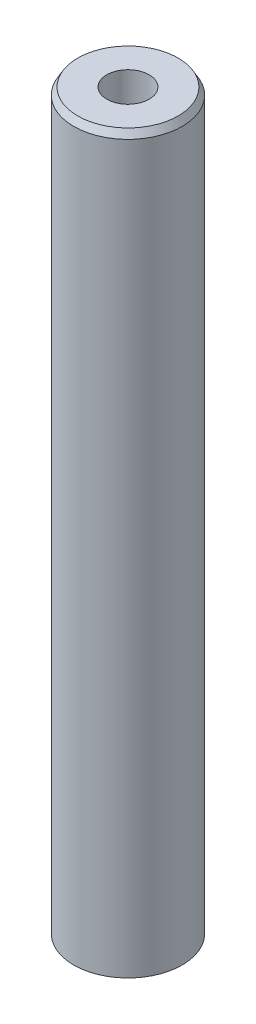
ISO-10303-21;
HEADER;
FILE_DESCRIPTION(('STEP AP214'),'2;1');
FILE_NAME('part.step','',(''),(''),'','','');
FILE_SCHEMA(('AUTOMOTIVE_DESIGN { 1 0 10303 214 1 1 1 1 }'));
ENDSEC;
DATA;
#1=APPLICATION_CONTEXT('core data for automotive mechanical design processes');
#2=APPLICATION_PROTOCOL_DEFINITION('international standard','automotive_design',2000,#1);
#3=PRODUCT_CONTEXT('',#1,'mechanical');
#4=PRODUCT('Part','Part','',(#3));
#5=PRODUCT_RELATED_PRODUCT_CATEGORY('part','',(#4));
#6=PRODUCT_DEFINITION_FORMATION('','',#4);
#7=PRODUCT_DEFINITION_CONTEXT('part definition',#1,'design');
#8=PRODUCT_DEFINITION('design','',#6,#7);
#9=PRODUCT_DEFINITION_SHAPE('','',#8);
#10=(LENGTH_UNIT() NAMED_UNIT(*) SI_UNIT(.MILLI.,.METRE.));
#11=(NAMED_UNIT(*) PLANE_ANGLE_UNIT() SI_UNIT($,.RADIAN.));
#12=(NAMED_UNIT(*) SI_UNIT($,.STERADIAN.) SOLID_ANGLE_UNIT());
#13=UNCERTAINTY_MEASURE_WITH_UNIT(LENGTH_MEASURE(1.E-05),#10,'distance_accuracy_value','');
#14=(GEOMETRIC_REPRESENTATION_CONTEXT(3) GLOBAL_UNCERTAINTY_ASSIGNED_CONTEXT((#13)) GLOBAL_UNIT_ASSIGNED_CONTEXT((#10,
#11,#12)) REPRESENTATION_CONTEXT('',''));
#15=CARTESIAN_POINT('',(0.,0.,0.));
#16=DIRECTION('',(0.,0.,1.));
#17=DIRECTION('',(1.,0.,0.));
#18=AXIS2_PLACEMENT_3D('',#15,#16,#17);
#19=CARTESIAN_POINT('',(0.,475.651455257944,0.));
#20=DIRECTION('',(0.,-1.,0.));
#21=DIRECTION('',(0.,0.,-1.));
#22=AXIS2_PLACEMENT_3D('',#19,#20,#21);
#23=CYLINDRICAL_SURFACE('',#22,35.);
#24=CARTESIAN_POINT('',(0.,471.122958494088,0.));
#25=DIRECTION('',(0.,1.,0.));
#26=DIRECTION('',(0.,0.,1.));
#27=AXIS2_PLACEMENT_3D('',#24,#25,#26);
#28=CIRCLE('',#27,35.);
#29=CARTESIAN_POINT('',(0.,471.122958494088,35.));
#30=VERTEX_POINT('',#29);
#31=EDGE_CURVE('E50',#30,#30,#28,.F.);
#32=ORIENTED_EDGE('',*,*,#31,.T.);
#33=EDGE_LOOP('',(#32));
#34=FACE_BOUND('',#33,.T.);
#35=CARTESIAN_POINT('',(0.,2.61452882563645,0.));
#36=DIRECTION('',(0.,1.,0.));
#37=DIRECTION('',(0.,0.,1.));
#38=AXIS2_PLACEMENT_3D('',#35,#36,#37);
#39=CIRCLE('',#38,35.);
#40=CARTESIAN_POINT('',(0.,2.61452882563645,35.));
#41=VERTEX_POINT('',#40);
#42=EDGE_CURVE('E51',#41,#41,#39,.T.);
#43=ORIENTED_EDGE('',*,*,#42,.T.);
#44=EDGE_LOOP('',(#43));
#45=FACE_BOUND('',#44,.T.);
#46=ADVANCED_FACE('F39',(#34,#45),#23,.T.);
#47=CARTESIAN_POINT('',(0.,475.651455257944,0.));
#48=DIRECTION('',(0.,1.,0.));
#49=DIRECTION('',(0.,0.,1.));
#50=AXIS2_PLACEMENT_3D('',#47,#48,#49);
#51=PLANE('',#50);
#52=CARTESIAN_POINT('',(0.,475.651455257944,0.));
#53=DIRECTION('',(0.,1.,0.));
#54=DIRECTION('',(0.,0.,1.));
#55=AXIS2_PLACEMENT_3D('',#52,#53,#54);
#56=CIRCLE('',#55,32.3854711743635);
#57=CARTESIAN_POINT('',(0.,475.651455257944,32.3854711743635));
#58=VERTEX_POINT('',#57);
#59=EDGE_CURVE('E54',#58,#58,#56,.T.);
#60=ORIENTED_EDGE('',*,*,#59,.T.);
#61=EDGE_LOOP('',(#60));
#62=FACE_BOUND('',#61,.T.);
#63=CARTESIAN_POINT('',(0.,475.651455257944,0.));
#64=DIRECTION('',(0.,1.,0.));
#65=DIRECTION('',(0.,0.,1.));
#66=AXIS2_PLACEMENT_3D('',#63,#64,#65);
#67=CIRCLE('',#66,13.674085344769);
#68=CARTESIAN_POINT('',(0.,475.651455257944,13.674085344769));
#69=VERTEX_POINT('',#68);
#70=EDGE_CURVE('E58',#69,#69,#67,.T.);
#71=ORIENTED_EDGE('',*,*,#70,.F.);
#72=EDGE_LOOP('',(#71));
#73=FACE_BOUND('',#72,.T.);
#74=ADVANCED_FACE('F69',(#62,#73),#51,.T.);
#75=CARTESIAN_POINT('',(0.,0.,0.));
#76=DIRECTION('',(0.,1.,0.));
#77=DIRECTION('',(0.,0.,1.));
#78=AXIS2_PLACEMENT_3D('',#75,#76,#77);
#79=PLANE('',#78);
#80=CARTESIAN_POINT('',(0.,0.,0.));
#81=DIRECTION('',(0.,1.,0.));
#82=DIRECTION('',(0.,0.,1.));
#83=AXIS2_PLACEMENT_3D('',#80,#81,#82);
#84=CIRCLE('',#83,30.4715032361442);
#85=CARTESIAN_POINT('',(0.,0.,30.4715032361442));
#86=VERTEX_POINT('',#85);
#87=EDGE_CURVE('E10',#86,#86,#84,.F.);
#88=ORIENTED_EDGE('',*,*,#87,.T.);
#89=EDGE_LOOP('',(#88));
#90=FACE_BOUND('',#89,.T.);
#91=CARTESIAN_POINT('',(0.,0.,0.));
#92=DIRECTION('',(0.,1.,0.));
#93=DIRECTION('',(0.,0.,1.));
#94=AXIS2_PLACEMENT_3D('',#91,#92,#93);
#95=CIRCLE('',#94,13.674085344769);
#96=CARTESIAN_POINT('',(0.,0.,13.674085344769));
#97=VERTEX_POINT('',#96);
#98=EDGE_CURVE('E63',#97,#97,#95,.T.);
#99=ORIENTED_EDGE('',*,*,#98,.T.);
#100=EDGE_LOOP('',(#99));
#101=FACE_BOUND('',#100,.T.);
#102=ADVANCED_FACE('F75',(#90,#101),#79,.F.);
#103=CARTESIAN_POINT('',(0.,475.651455257944,0.));
#104=DIRECTION('',(0.,-1.,0.));
#105=DIRECTION('',(0.,0.,-1.));
#106=AXIS2_PLACEMENT_3D('',#103,#104,#105);
#107=CYLINDRICAL_SURFACE('',#106,13.674085344769);
#108=ORIENTED_EDGE('',*,*,#70,.T.);
#109=EDGE_LOOP('',(#108));
#110=FACE_BOUND('',#109,.T.);
#111=ORIENTED_EDGE('',*,*,#98,.F.);
#112=EDGE_LOOP('',(#111));
#113=FACE_BOUND('',#112,.T.);
#114=ADVANCED_FACE('F70',(#110,#113),#107,.F.);
#115=CARTESIAN_POINT('',(0.,475.651455257944,0.));
#116=DIRECTION('',(0.,-1.,0.));
#117=DIRECTION('',(0.,0.,-1.));
#118=AXIS2_PLACEMENT_3D('',#115,#116,#117);
#119=CONICAL_SURFACE('',#118,32.3854711743635,0.523598775598302);
#120=ORIENTED_EDGE('',*,*,#31,.F.);
#121=EDGE_LOOP('',(#120));
#122=FACE_BOUND('',#121,.T.);
#123=ORIENTED_EDGE('',*,*,#59,.F.);
#124=EDGE_LOOP('',(#123));
#125=FACE_BOUND('',#124,.T.);
#126=ADVANCED_FACE('F81',(#122,#125),#119,.T.);
#127=CARTESIAN_POINT('',(0.,2.61452882563645,0.));
#128=DIRECTION('',(0.,1.,0.));
#129=DIRECTION('',(0.,0.,1.));
#130=AXIS2_PLACEMENT_3D('',#127,#128,#129);
#131=CONICAL_SURFACE('',#130,35.,1.04719755119661);
#132=ORIENTED_EDGE('',*,*,#87,.F.);
#133=EDGE_LOOP('',(#132));
#134=FACE_BOUND('',#133,.T.);
#135=ORIENTED_EDGE('',*,*,#42,.F.);
#136=EDGE_LOOP('',(#135));
#137=FACE_BOUND('',#136,.T.);
#138=ADVANCED_FACE('F45',(#134,#137),#131,.T.);
#139=CLOSED_SHELL('',(#46,#74,#102,#114,#126,#138));
#140=MANIFOLD_SOLID_BREP('B2',#139);
#141=ADVANCED_BREP_SHAPE_REPRESENTATION('',(#18,#140),#14);
#142=SHAPE_DEFINITION_REPRESENTATION(#9,#141);
ENDSEC;
END-ISO-10303-21;
